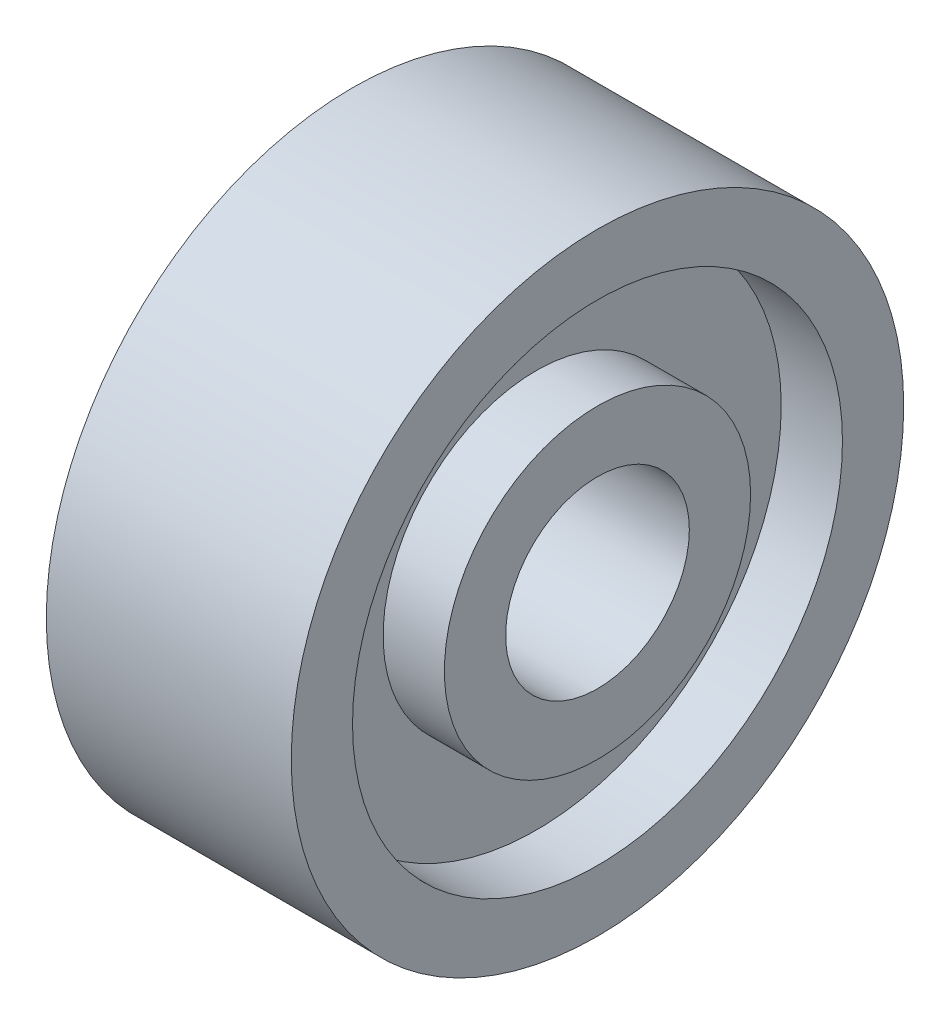
ISO-10303-21;
HEADER;
FILE_DESCRIPTION(('STEP AP214'),'2;1');
FILE_NAME('part.step','',(''),(''),'','','');
FILE_SCHEMA(('AUTOMOTIVE_DESIGN { 1 0 10303 214 1 1 1 1 }'));
ENDSEC;
DATA;
#1=APPLICATION_CONTEXT('core data for automotive mechanical design processes');
#2=APPLICATION_PROTOCOL_DEFINITION('international standard','automotive_design',2000,#1);
#3=PRODUCT_CONTEXT('',#1,'mechanical');
#4=PRODUCT('Part','Part','',(#3));
#5=PRODUCT_RELATED_PRODUCT_CATEGORY('part','',(#4));
#6=PRODUCT_DEFINITION_FORMATION('','',#4);
#7=PRODUCT_DEFINITION_CONTEXT('part definition',#1,'design');
#8=PRODUCT_DEFINITION('design','',#6,#7);
#9=PRODUCT_DEFINITION_SHAPE('','',#8);
#10=(LENGTH_UNIT() NAMED_UNIT(*) SI_UNIT(.MILLI.,.METRE.));
#11=(NAMED_UNIT(*) PLANE_ANGLE_UNIT() SI_UNIT($,.RADIAN.));
#12=(NAMED_UNIT(*) SI_UNIT($,.STERADIAN.) SOLID_ANGLE_UNIT());
#13=UNCERTAINTY_MEASURE_WITH_UNIT(LENGTH_MEASURE(1.E-05),#10,'distance_accuracy_value','');
#14=(GEOMETRIC_REPRESENTATION_CONTEXT(3) GLOBAL_UNCERTAINTY_ASSIGNED_CONTEXT((#13)) GLOBAL_UNIT_ASSIGNED_CONTEXT((#10,
#11,#12)) REPRESENTATION_CONTEXT('',''));
#15=CARTESIAN_POINT('',(0.,0.,0.));
#16=DIRECTION('',(0.,0.,1.));
#17=DIRECTION('',(1.,0.,0.));
#18=AXIS2_PLACEMENT_3D('',#15,#16,#17);
#19=CARTESIAN_POINT('',(2.,0.,0.));
#20=DIRECTION('',(1.,0.,0.));
#21=DIRECTION('',(0.,0.,-1.));
#22=AXIS2_PLACEMENT_3D('',#19,#20,#21);
#23=CYLINDRICAL_SURFACE('',#22,5.);
#24=CARTESIAN_POINT('',(4.,0.,0.));
#25=DIRECTION('',(1.,0.,0.));
#26=DIRECTION('',(0.,0.,-1.));
#27=AXIS2_PLACEMENT_3D('',#24,#25,#26);
#28=CIRCLE('',#27,5.);
#29=CARTESIAN_POINT('',(4.,0.,-5.));
#30=VERTEX_POINT('',#29);
#31=EDGE_CURVE('E9',#30,#30,#28,.T.);
#32=ORIENTED_EDGE('',*,*,#31,.F.);
#33=EDGE_LOOP('',(#32));
#34=FACE_BOUND('',#33,.T.);
#35=CARTESIAN_POINT('',(0.,0.,0.));
#36=DIRECTION('',(1.,0.,0.));
#37=DIRECTION('',(0.,0.,-1.));
#38=AXIS2_PLACEMENT_3D('',#35,#36,#37);
#39=CIRCLE('',#38,5.);
#40=CARTESIAN_POINT('',(0.,0.,-5.));
#41=VERTEX_POINT('',#40);
#42=EDGE_CURVE('E36',#41,#41,#39,.T.);
#43=ORIENTED_EDGE('',*,*,#42,.T.);
#44=EDGE_LOOP('',(#43));
#45=FACE_BOUND('',#44,.T.);
#46=ADVANCED_FACE('F14',(#34,#45),#23,.T.);
#47=CARTESIAN_POINT('',(2.,0.,0.));
#48=DIRECTION('',(1.,0.,0.));
#49=DIRECTION('',(0.,0.,-1.));
#50=AXIS2_PLACEMENT_3D('',#47,#48,#49);
#51=CYLINDRICAL_SURFACE('',#50,1.5);
#52=CARTESIAN_POINT('',(4.,0.,0.));
#53=DIRECTION('',(1.,0.,0.));
#54=DIRECTION('',(0.,0.,-1.));
#55=AXIS2_PLACEMENT_3D('',#52,#53,#54);
#56=CIRCLE('',#55,1.5);
#57=CARTESIAN_POINT('',(4.,0.,-1.5));
#58=VERTEX_POINT('',#57);
#59=EDGE_CURVE('E41',#58,#58,#56,.T.);
#60=ORIENTED_EDGE('',*,*,#59,.T.);
#61=EDGE_LOOP('',(#60));
#62=FACE_BOUND('',#61,.T.);
#63=CARTESIAN_POINT('',(0.,0.,0.));
#64=DIRECTION('',(1.,0.,0.));
#65=DIRECTION('',(0.,0.,-1.));
#66=AXIS2_PLACEMENT_3D('',#63,#64,#65);
#67=CIRCLE('',#66,1.5);
#68=CARTESIAN_POINT('',(0.,0.,-1.5));
#69=VERTEX_POINT('',#68);
#70=EDGE_CURVE('E23',#69,#69,#67,.T.);
#71=ORIENTED_EDGE('',*,*,#70,.F.);
#72=EDGE_LOOP('',(#71));
#73=FACE_BOUND('',#72,.T.);
#74=ADVANCED_FACE('F89',(#62,#73),#51,.F.);
#75=CARTESIAN_POINT('',(4.,0.,0.));
#76=DIRECTION('',(1.,0.,0.));
#77=DIRECTION('',(0.,0.,-1.));
#78=AXIS2_PLACEMENT_3D('',#75,#76,#77);
#79=PLANE('',#78);
#80=ORIENTED_EDGE('',*,*,#31,.T.);
#81=EDGE_LOOP('',(#80));
#82=FACE_BOUND('',#81,.T.);
#83=CARTESIAN_POINT('',(4.,0.,0.));
#84=DIRECTION('',(1.,0.,0.));
#85=DIRECTION('',(0.,0.,-1.));
#86=AXIS2_PLACEMENT_3D('',#83,#84,#85);
#87=CIRCLE('',#86,4.);
#88=CARTESIAN_POINT('',(4.,0.,-4.));
#89=VERTEX_POINT('',#88);
#90=EDGE_CURVE('E33',#89,#89,#87,.T.);
#91=ORIENTED_EDGE('',*,*,#90,.F.);
#92=EDGE_LOOP('',(#91));
#93=FACE_BOUND('',#92,.T.);
#94=ADVANCED_FACE('F95',(#82,#93),#79,.T.);
#95=CARTESIAN_POINT('',(4.,0.,0.));
#96=DIRECTION('',(1.,0.,0.));
#97=DIRECTION('',(0.,0.,-1.));
#98=AXIS2_PLACEMENT_3D('',#95,#96,#97);
#99=PLANE('',#98);
#100=CARTESIAN_POINT('',(4.,0.,0.));
#101=DIRECTION('',(1.,0.,0.));
#102=DIRECTION('',(0.,0.,-1.));
#103=AXIS2_PLACEMENT_3D('',#100,#101,#102);
#104=CIRCLE('',#103,2.5);
#105=CARTESIAN_POINT('',(4.,0.,-2.5));
#106=VERTEX_POINT('',#105);
#107=EDGE_CURVE('E38',#106,#106,#104,.T.);
#108=ORIENTED_EDGE('',*,*,#107,.T.);
#109=EDGE_LOOP('',(#108));
#110=FACE_BOUND('',#109,.T.);
#111=ORIENTED_EDGE('',*,*,#59,.F.);
#112=EDGE_LOOP('',(#111));
#113=FACE_BOUND('',#112,.T.);
#114=ADVANCED_FACE('F102',(#110,#113),#99,.T.);
#115=CARTESIAN_POINT('',(3.5,0.,0.));
#116=DIRECTION('',(1.,0.,0.));
#117=DIRECTION('',(0.,0.,-1.));
#118=AXIS2_PLACEMENT_3D('',#115,#116,#117);
#119=CYLINDRICAL_SURFACE('',#118,4.);
#120=CARTESIAN_POINT('',(3.,0.,0.));
#121=DIRECTION('',(1.,0.,0.));
#122=DIRECTION('',(0.,0.,-1.));
#123=AXIS2_PLACEMENT_3D('',#120,#121,#122);
#124=CIRCLE('',#123,4.);
#125=CARTESIAN_POINT('',(3.,0.,-4.));
#126=VERTEX_POINT('',#125);
#127=EDGE_CURVE('E45',#126,#126,#124,.T.);
#128=ORIENTED_EDGE('',*,*,#127,.F.);
#129=EDGE_LOOP('',(#128));
#130=FACE_BOUND('',#129,.T.);
#131=ORIENTED_EDGE('',*,*,#90,.T.);
#132=EDGE_LOOP('',(#131));
#133=FACE_BOUND('',#132,.T.);
#134=ADVANCED_FACE('F105',(#130,#133),#119,.F.);
#135=CARTESIAN_POINT('',(3.,0.,0.));
#136=DIRECTION('',(1.,0.,0.));
#137=DIRECTION('',(0.,0.,-1.));
#138=AXIS2_PLACEMENT_3D('',#135,#136,#137);
#139=PLANE('',#138);
#140=ORIENTED_EDGE('',*,*,#127,.T.);
#141=EDGE_LOOP('',(#140));
#142=FACE_BOUND('',#141,.T.);
#143=CARTESIAN_POINT('',(3.,0.,0.));
#144=DIRECTION('',(1.,0.,0.));
#145=DIRECTION('',(0.,0.,-1.));
#146=AXIS2_PLACEMENT_3D('',#143,#144,#145);
#147=CIRCLE('',#146,2.5);
#148=CARTESIAN_POINT('',(3.,0.,-2.5));
#149=VERTEX_POINT('',#148);
#150=EDGE_CURVE('E52',#149,#149,#147,.T.);
#151=ORIENTED_EDGE('',*,*,#150,.F.);
#152=EDGE_LOOP('',(#151));
#153=FACE_BOUND('',#152,.T.);
#154=ADVANCED_FACE('F109',(#142,#153),#139,.T.);
#155=CARTESIAN_POINT('',(3.5,0.,0.));
#156=DIRECTION('',(1.,0.,0.));
#157=DIRECTION('',(0.,0.,-1.));
#158=AXIS2_PLACEMENT_3D('',#155,#156,#157);
#159=CYLINDRICAL_SURFACE('',#158,2.5);
#160=ORIENTED_EDGE('',*,*,#150,.T.);
#161=EDGE_LOOP('',(#160));
#162=FACE_BOUND('',#161,.T.);
#163=ORIENTED_EDGE('',*,*,#107,.F.);
#164=EDGE_LOOP('',(#163));
#165=FACE_BOUND('',#164,.T.);
#166=ADVANCED_FACE('F113',(#162,#165),#159,.T.);
#167=CARTESIAN_POINT('',(0.,0.,0.));
#168=DIRECTION('',(1.,0.,0.));
#169=DIRECTION('',(0.,0.,-1.));
#170=AXIS2_PLACEMENT_3D('',#167,#168,#169);
#171=PLANE('',#170);
#172=ORIENTED_EDGE('',*,*,#42,.F.);
#173=EDGE_LOOP('',(#172));
#174=FACE_BOUND('',#173,.T.);
#175=CARTESIAN_POINT('',(0.,0.,0.));
#176=DIRECTION('',(-1.,0.,0.));
#177=DIRECTION('',(0.,0.,-1.));
#178=AXIS2_PLACEMENT_3D('',#175,#176,#177);
#179=CIRCLE('',#178,4.);
#180=CARTESIAN_POINT('',(0.,0.,-4.));
#181=VERTEX_POINT('',#180);
#182=EDGE_CURVE('E39',#181,#181,#179,.T.);
#183=ORIENTED_EDGE('',*,*,#182,.F.);
#184=EDGE_LOOP('',(#183));
#185=FACE_BOUND('',#184,.T.);
#186=ADVANCED_FACE('F117',(#174,#185),#171,.F.);
#187=CARTESIAN_POINT('',(0.,0.,0.));
#188=DIRECTION('',(1.,0.,0.));
#189=DIRECTION('',(0.,0.,-1.));
#190=AXIS2_PLACEMENT_3D('',#187,#188,#189);
#191=PLANE('',#190);
#192=CARTESIAN_POINT('',(0.,0.,0.));
#193=DIRECTION('',(-1.,0.,0.));
#194=DIRECTION('',(0.,0.,-1.));
#195=AXIS2_PLACEMENT_3D('',#192,#193,#194);
#196=CIRCLE('',#195,2.5);
#197=CARTESIAN_POINT('',(0.,0.,-2.5));
#198=VERTEX_POINT('',#197);
#199=EDGE_CURVE('E63',#198,#198,#196,.T.);
#200=ORIENTED_EDGE('',*,*,#199,.T.);
#201=EDGE_LOOP('',(#200));
#202=FACE_BOUND('',#201,.T.);
#203=ORIENTED_EDGE('',*,*,#70,.T.);
#204=EDGE_LOOP('',(#203));
#205=FACE_BOUND('',#204,.T.);
#206=ADVANCED_FACE('F85',(#202,#205),#191,.F.);
#207=CARTESIAN_POINT('',(0.5,0.,0.));
#208=DIRECTION('',(-1.,0.,0.));
#209=DIRECTION('',(0.,0.,1.));
#210=AXIS2_PLACEMENT_3D('',#207,#208,#209);
#211=CYLINDRICAL_SURFACE('',#210,4.);
#212=CARTESIAN_POINT('',(1.,0.,0.));
#213=DIRECTION('',(-1.,0.,0.));
#214=DIRECTION('',(0.,0.,1.));
#215=AXIS2_PLACEMENT_3D('',#212,#213,#214);
#216=CIRCLE('',#215,4.);
#217=CARTESIAN_POINT('',(1.,0.,4.));
#218=VERTEX_POINT('',#217);
#219=EDGE_CURVE('E62',#218,#218,#216,.T.);
#220=ORIENTED_EDGE('',*,*,#219,.F.);
#221=EDGE_LOOP('',(#220));
#222=FACE_BOUND('',#221,.T.);
#223=ORIENTED_EDGE('',*,*,#182,.T.);
#224=EDGE_LOOP('',(#223));
#225=FACE_BOUND('',#224,.T.);
#226=ADVANCED_FACE('F79',(#222,#225),#211,.F.);
#227=CARTESIAN_POINT('',(1.,0.,0.));
#228=DIRECTION('',(-1.,0.,0.));
#229=DIRECTION('',(0.,0.,1.));
#230=AXIS2_PLACEMENT_3D('',#227,#228,#229);
#231=PLANE('',#230);
#232=ORIENTED_EDGE('',*,*,#219,.T.);
#233=EDGE_LOOP('',(#232));
#234=FACE_BOUND('',#233,.T.);
#235=CARTESIAN_POINT('',(1.,0.,0.));
#236=DIRECTION('',(-1.,0.,0.));
#237=DIRECTION('',(0.,0.,1.));
#238=AXIS2_PLACEMENT_3D('',#235,#236,#237);
#239=CIRCLE('',#238,2.5);
#240=CARTESIAN_POINT('',(1.,0.,2.5));
#241=VERTEX_POINT('',#240);
#242=EDGE_CURVE('E18',#241,#241,#239,.T.);
#243=ORIENTED_EDGE('',*,*,#242,.F.);
#244=EDGE_LOOP('',(#243));
#245=FACE_BOUND('',#244,.T.);
#246=ADVANCED_FACE('F77',(#234,#245),#231,.T.);
#247=CARTESIAN_POINT('',(0.5,0.,0.));
#248=DIRECTION('',(-1.,0.,0.));
#249=DIRECTION('',(0.,0.,1.));
#250=AXIS2_PLACEMENT_3D('',#247,#248,#249);
#251=CYLINDRICAL_SURFACE('',#250,2.5);
#252=ORIENTED_EDGE('',*,*,#242,.T.);
#253=EDGE_LOOP('',(#252));
#254=FACE_BOUND('',#253,.T.);
#255=ORIENTED_EDGE('',*,*,#199,.F.);
#256=EDGE_LOOP('',(#255));
#257=FACE_BOUND('',#256,.T.);
#258=ADVANCED_FACE('F16',(#254,#257),#251,.T.);
#259=CLOSED_SHELL('',(#46,#74,#94,#114,#134,#154,#166,#186,#206,#226,#246,#258));
#260=MANIFOLD_SOLID_BREP('B1',#259);
#261=ADVANCED_BREP_SHAPE_REPRESENTATION('',(#18,#260),#14);
#262=SHAPE_DEFINITION_REPRESENTATION(#9,#261);
ENDSEC;
END-ISO-10303-21;
